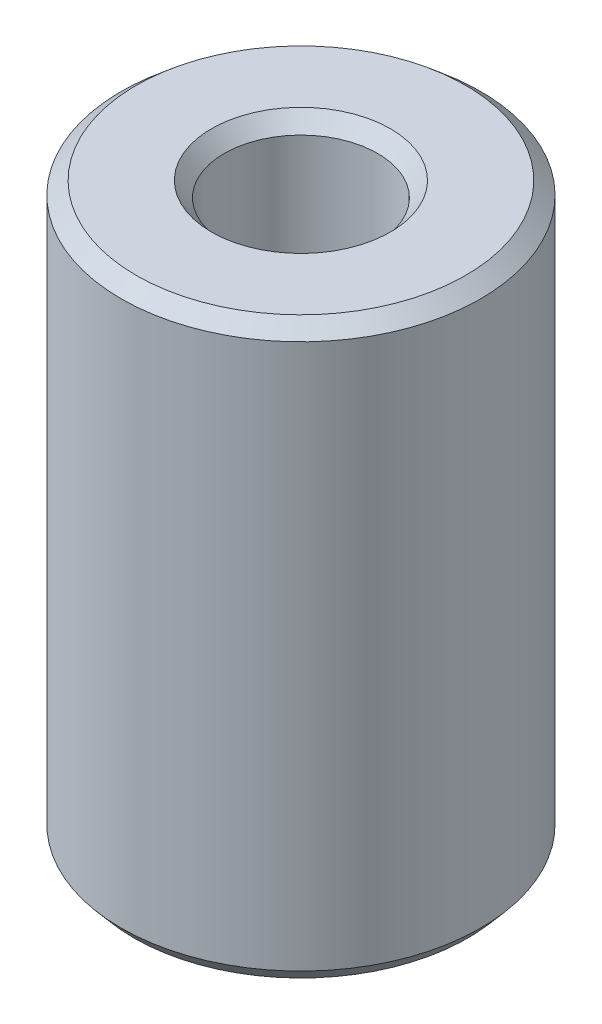
ISO-10303-21;
HEADER;
FILE_DESCRIPTION(('STEP AP214'),'2;1');
FILE_NAME('part.step','',(''),(''),'','','');
FILE_SCHEMA(('AUTOMOTIVE_DESIGN { 1 0 10303 214 1 1 1 1 }'));
ENDSEC;
DATA;
#1=APPLICATION_CONTEXT('core data for automotive mechanical design processes');
#2=APPLICATION_PROTOCOL_DEFINITION('international standard','automotive_design',2000,#1);
#3=PRODUCT_CONTEXT('',#1,'mechanical');
#4=PRODUCT('Part','Part','',(#3));
#5=PRODUCT_RELATED_PRODUCT_CATEGORY('part','',(#4));
#6=PRODUCT_DEFINITION_FORMATION('','',#4);
#7=PRODUCT_DEFINITION_CONTEXT('part definition',#1,'design');
#8=PRODUCT_DEFINITION('design','',#6,#7);
#9=PRODUCT_DEFINITION_SHAPE('','',#8);
#10=(LENGTH_UNIT() NAMED_UNIT(*) SI_UNIT(.MILLI.,.METRE.));
#11=(NAMED_UNIT(*) PLANE_ANGLE_UNIT() SI_UNIT($,.RADIAN.));
#12=(NAMED_UNIT(*) SI_UNIT($,.STERADIAN.) SOLID_ANGLE_UNIT());
#13=UNCERTAINTY_MEASURE_WITH_UNIT(LENGTH_MEASURE(1.E-05),#10,'distance_accuracy_value','');
#14=(GEOMETRIC_REPRESENTATION_CONTEXT(3) GLOBAL_UNCERTAINTY_ASSIGNED_CONTEXT((#13)) GLOBAL_UNIT_ASSIGNED_CONTEXT((#10,
#11,#12)) REPRESENTATION_CONTEXT('',''));
#15=CARTESIAN_POINT('',(0.,0.,0.));
#16=DIRECTION('',(0.,0.,1.));
#17=DIRECTION('',(1.,0.,0.));
#18=AXIS2_PLACEMENT_3D('',#15,#16,#17);
#19=CARTESIAN_POINT('',(0.,135.474291999624,0.));
#20=DIRECTION('',(0.,-1.,0.));
#21=DIRECTION('',(0.,0.,-1.));
#22=AXIS2_PLACEMENT_3D('',#19,#20,#21);
#23=CYLINDRICAL_SURFACE('',#22,42.5);
#24=CARTESIAN_POINT('',(0.,3.55246340525472,0.));
#25=DIRECTION('',(0.,1.,0.));
#26=DIRECTION('',(0.,0.,1.));
#27=AXIS2_PLACEMENT_3D('',#24,#25,#26);
#28=CIRCLE('',#27,42.5);
#29=CARTESIAN_POINT('',(0.,3.55246340525472,42.5));
#30=VERTEX_POINT('',#29);
#31=EDGE_CURVE('E10',#30,#30,#28,.T.);
#32=ORIENTED_EDGE('',*,*,#31,.T.);
#33=EDGE_LOOP('',(#32));
#34=FACE_BOUND('',#33,.T.);
#35=CARTESIAN_POINT('',(0.,132.453526323723,0.));
#36=DIRECTION('',(0.,1.,0.));
#37=DIRECTION('',(0.,0.,1.));
#38=AXIS2_PLACEMENT_3D('',#35,#36,#37);
#39=CIRCLE('',#38,42.5);
#40=CARTESIAN_POINT('',(0.,132.453526323723,42.5));
#41=VERTEX_POINT('',#40);
#42=EDGE_CURVE('E50',#41,#41,#39,.F.);
#43=ORIENTED_EDGE('',*,*,#42,.T.);
#44=EDGE_LOOP('',(#43));
#45=FACE_BOUND('',#44,.T.);
#46=ADVANCED_FACE('F39',(#34,#45),#23,.T.);
#47=CARTESIAN_POINT('',(0.,135.474291999624,0.));
#48=DIRECTION('',(0.,1.,0.));
#49=DIRECTION('',(0.,0.,1.));
#50=AXIS2_PLACEMENT_3D('',#47,#48,#49);
#51=PLANE('',#50);
#52=CARTESIAN_POINT('',(0.,135.474291999624,0.));
#53=DIRECTION('',(0.,1.,0.));
#54=DIRECTION('',(0.,0.,1.));
#55=AXIS2_PLACEMENT_3D('',#52,#53,#54);
#56=CIRCLE('',#55,21.1725533555586);
#57=CARTESIAN_POINT('',(0.,135.474291999624,21.1725533555586));
#58=VERTEX_POINT('',#57);
#59=EDGE_CURVE('E58',#58,#58,#56,.F.);
#60=ORIENTED_EDGE('',*,*,#59,.T.);
#61=EDGE_LOOP('',(#60));
#62=FACE_BOUND('',#61,.T.);
#63=CARTESIAN_POINT('',(0.,135.474291999624,0.));
#64=DIRECTION('',(0.,1.,0.));
#65=DIRECTION('',(0.,0.,1.));
#66=AXIS2_PLACEMENT_3D('',#63,#64,#65);
#67=CIRCLE('',#66,38.9475365947453);
#68=CARTESIAN_POINT('',(0.,135.474291999624,38.9475365947453));
#69=VERTEX_POINT('',#68);
#70=EDGE_CURVE('E61',#69,#69,#67,.T.);
#71=ORIENTED_EDGE('',*,*,#70,.T.);
#72=EDGE_LOOP('',(#71));
#73=FACE_BOUND('',#72,.T.);
#74=ADVANCED_FACE('F88',(#62,#73),#51,.T.);
#75=CARTESIAN_POINT('',(0.,0.,0.));
#76=DIRECTION('',(0.,1.,0.));
#77=DIRECTION('',(0.,0.,1.));
#78=AXIS2_PLACEMENT_3D('',#75,#76,#77);
#79=PLANE('',#78);
#80=CARTESIAN_POINT('',(0.,0.,0.));
#81=DIRECTION('',(0.,1.,0.));
#82=DIRECTION('',(0.,0.,1.));
#83=AXIS2_PLACEMENT_3D('',#80,#81,#82);
#84=CIRCLE('',#83,21.7042510849124);
#85=CARTESIAN_POINT('',(0.,0.,21.7042510849124));
#86=VERTEX_POINT('',#85);
#87=EDGE_CURVE('E51',#86,#86,#84,.T.);
#88=ORIENTED_EDGE('',*,*,#87,.T.);
#89=EDGE_LOOP('',(#88));
#90=FACE_BOUND('',#89,.T.);
#91=CARTESIAN_POINT('',(0.,0.,0.));
#92=DIRECTION('',(0.,1.,0.));
#93=DIRECTION('',(0.,0.,1.));
#94=AXIS2_PLACEMENT_3D('',#91,#92,#93);
#95=CIRCLE('',#94,39.479234324099);
#96=CARTESIAN_POINT('',(0.,0.,39.479234324099));
#97=VERTEX_POINT('',#96);
#98=EDGE_CURVE('E54',#97,#97,#95,.F.);
#99=ORIENTED_EDGE('',*,*,#98,.T.);
#100=EDGE_LOOP('',(#99));
#101=FACE_BOUND('',#100,.T.);
#102=ADVANCED_FACE('F83',(#90,#101),#79,.F.);
#103=CARTESIAN_POINT('',(0.,135.474291999624,0.));
#104=DIRECTION('',(0.,-1.,0.));
#105=DIRECTION('',(0.,0.,-1.));
#106=AXIS2_PLACEMENT_3D('',#103,#104,#105);
#107=CYLINDRICAL_SURFACE('',#106,18.1517876796576);
#108=CARTESIAN_POINT('',(0.,131.921828594369,0.));
#109=DIRECTION('',(0.,1.,0.));
#110=DIRECTION('',(0.,0.,1.));
#111=AXIS2_PLACEMENT_3D('',#108,#109,#110);
#112=CIRCLE('',#111,18.1517876796576);
#113=CARTESIAN_POINT('',(0.,131.921828594369,18.1517876796576));
#114=VERTEX_POINT('',#113);
#115=EDGE_CURVE('E67',#114,#114,#112,.T.);
#116=ORIENTED_EDGE('',*,*,#115,.T.);
#117=EDGE_LOOP('',(#116));
#118=FACE_BOUND('',#117,.T.);
#119=CARTESIAN_POINT('',(0.,3.02076567590104,0.));
#120=DIRECTION('',(0.,1.,0.));
#121=DIRECTION('',(0.,0.,1.));
#122=AXIS2_PLACEMENT_3D('',#119,#120,#121);
#123=CIRCLE('',#122,18.1517876796576);
#124=CARTESIAN_POINT('',(0.,3.02076567590104,18.1517876796576));
#125=VERTEX_POINT('',#124);
#126=EDGE_CURVE('E69',#125,#125,#123,.F.);
#127=ORIENTED_EDGE('',*,*,#126,.T.);
#128=EDGE_LOOP('',(#127));
#129=FACE_BOUND('',#128,.T.);
#130=ADVANCED_FACE('F71',(#118,#129),#107,.F.);
#131=CARTESIAN_POINT('',(0.,131.921828594369,0.));
#132=DIRECTION('',(0.,1.,0.));
#133=DIRECTION('',(0.,0.,1.));
#134=AXIS2_PLACEMENT_3D('',#131,#132,#133);
#135=CONICAL_SURFACE('',#134,18.1517876796576,0.704685528220858);
#136=CARTESIAN_POINT('',(0.,135.474291999624,21.1725533555586));
#137=CARTESIAN_POINT('',(0.,135.437287172486,21.1410870464347));
#138=CARTESIAN_POINT('',(0.,135.400282345347,21.1096207373107));
#139=CARTESIAN_POINT('',(0.,135.326272691071,21.0466881190627));
#140=CARTESIAN_POINT('',(0.,135.289267863933,21.0152218099388));
#141=CARTESIAN_POINT('',(0.,135.215258209657,20.9522891916908));
#142=CARTESIAN_POINT('',(0.,135.178253382519,20.9208228825669));
#143=CARTESIAN_POINT('',(0.,135.104243728243,20.8578902643189));
#144=CARTESIAN_POINT('',(0.,135.067238901105,20.826423955195));
#145=CARTESIAN_POINT('',(0.,134.993229246829,20.763491336947));
#146=CARTESIAN_POINT('',(0.,134.956224419691,20.7320250278231));
#147=CARTESIAN_POINT('',(0.,134.882214765415,20.6690924095751));
#148=CARTESIAN_POINT('',(0.,134.845209938276,20.6376261004512));
#149=CARTESIAN_POINT('',(0.,134.771200284,20.5746934822032));
#150=CARTESIAN_POINT('',(0.,134.734195456862,20.5432271730792));
#151=CARTESIAN_POINT('',(0.,134.660185802586,20.4802945548313));
#152=CARTESIAN_POINT('',(0.,134.623180975448,20.4488282457073));
#153=CARTESIAN_POINT('',(0.,134.549171321172,20.3858956274594));
#154=CARTESIAN_POINT('',(0.,134.512166494034,20.3544293183354));
#155=CARTESIAN_POINT('',(0.,134.438156839758,20.2914967000875));
#156=CARTESIAN_POINT('',(0.,134.40115201262,20.2600303909635));
#157=CARTESIAN_POINT('',(0.,134.327142358343,20.1970977727156));
#158=CARTESIAN_POINT('',(0.,134.290137531205,20.1656314635916));
#159=CARTESIAN_POINT('',(0.,134.216127876929,20.1026988453437));
#160=CARTESIAN_POINT('',(0.,134.179123049791,20.0712325362197));
#161=CARTESIAN_POINT('',(0.,134.105113395515,20.0082999179718));
#162=CARTESIAN_POINT('',(0.,134.068108568377,19.9768336088478));
#163=CARTESIAN_POINT('',(0.,133.994098914101,19.9139009905999));
#164=CARTESIAN_POINT('',(0.,133.957094086963,19.8824346814759));
#165=CARTESIAN_POINT('',(0.,133.883084432687,19.819502063228));
#166=CARTESIAN_POINT('',(0.,133.846079605549,19.788035754104));
#167=CARTESIAN_POINT('',(0.,133.772069951272,19.7251031358561));
#168=CARTESIAN_POINT('',(0.,133.735065124134,19.6936368267321));
#169=CARTESIAN_POINT('',(0.,133.661055469858,19.6307042084842));
#170=CARTESIAN_POINT('',(0.,133.62405064272,19.5992378993602));
#171=CARTESIAN_POINT('',(0.,133.550040988444,19.5363052811122));
#172=CARTESIAN_POINT('',(0.,133.513036161306,19.5048389719883));
#173=CARTESIAN_POINT('',(0.,133.43902650703,19.4419063537403));
#174=CARTESIAN_POINT('',(0.,133.402021679892,19.4104400446164));
#175=CARTESIAN_POINT('',(0.,133.328012025616,19.3475074263684));
#176=CARTESIAN_POINT('',(0.,133.291007198477,19.3160411172445));
#177=CARTESIAN_POINT('',(0.,133.216997544201,19.2531084989965));
#178=CARTESIAN_POINT('',(0.,133.179992717063,19.2216421898726));
#179=CARTESIAN_POINT('',(0.,133.105983062787,19.1587095716246));
#180=CARTESIAN_POINT('',(0.,133.068978235649,19.1272432625007));
#181=CARTESIAN_POINT('',(0.,132.994968581373,19.0643106442527));
#182=CARTESIAN_POINT('',(0.,132.957963754235,19.0328443351287));
#183=CARTESIAN_POINT('',(0.,132.883954099959,18.9699117168808));
#184=CARTESIAN_POINT('',(0.,132.846949272821,18.9384454077568));
#185=CARTESIAN_POINT('',(0.,132.772939618545,18.8755127895089));
#186=CARTESIAN_POINT('',(0.,132.735934791406,18.8440464803849));
#187=CARTESIAN_POINT('',(0.,132.66192513713,18.781113862137));
#188=CARTESIAN_POINT('',(0.,132.624920309992,18.749647553013));
#189=CARTESIAN_POINT('',(0.,132.550910655716,18.6867149347651));
#190=CARTESIAN_POINT('',(0.,132.513905828578,18.6552486256411));
#191=CARTESIAN_POINT('',(0.,132.439896174302,18.5923160073932));
#192=CARTESIAN_POINT('',(0.,132.402891347164,18.5608496982692));
#193=CARTESIAN_POINT('',(0.,132.328881692888,18.4979170800213));
#194=CARTESIAN_POINT('',(0.,132.29187686575,18.4664507708973));
#195=CARTESIAN_POINT('',(0.,132.217867211473,18.4035181526494));
#196=CARTESIAN_POINT('',(0.,132.180862384335,18.3720518435254));
#197=CARTESIAN_POINT('',(0.,132.106852730059,18.3091192252775));
#198=CARTESIAN_POINT('',(0.,132.069847902921,18.2776529161535));
#199=CARTESIAN_POINT('',(0.,131.995838248645,18.2147202979056));
#200=CARTESIAN_POINT('',(0.,131.958833421507,18.1832539887816));
#201=CARTESIAN_POINT('',(0.,131.921828594369,18.1517876796576));
#202=B_SPLINE_CURVE_WITH_KNOTS('',3,(#136,#137,#138,#139,#140,#141,#142,#143,#144,#145,#146,
#147,#148,#149,#150,#151,#152,#153,#154,#155,#156,#157,#158,#159,#160,#161,#162,#163,#164,#165,
#166,#167,#168,#169,#170,#171,#172,#173,#174,#175,#176,#177,#178,#179,#180,#181,#182,#183,#184,
#185,#186,#187,#188,#189,#190,#191,#192,#193,#194,#195,#196,#197,#198,#199,#200,#201),
.UNSPECIFIED.,.F.,.F.,(4,2,2,2,2,2,2,2,2,2,2,2,2,2,2,2,2,2,2,2,2,2,2,2,2,2,2,2,2,2,2,2,4),(0.,
0.145723617072289,0.291447234144581,0.43717085121687,0.582894468289162,0.728618085361454,
0.874341702433743,1.02006531950603,1.16578893657835,1.31151255365064,1.45723617072293,
1.60295978779522,1.74868340486751,1.8944070219398,2.04013063901209,2.18585425608438,
2.33157787315669,2.47730149022898,2.62302510730128,2.76874872437357,2.91447234144586,
3.06019595851815,3.20591957559044,3.35164319266273,3.49736680973504,3.64309042680733,
3.78881404387962,3.93453766095191,4.0802612780242,4.2259848950965,4.37170851216878,
4.51743212924108,4.66315574631337),.UNSPECIFIED.);
#203=EDGE_CURVE('BSEAM77',#58,#114,#202,.T.);
#204=ORIENTED_EDGE('',*,*,#59,.F.);
#205=ORIENTED_EDGE('',*,*,#115,.F.);
#206=ORIENTED_EDGE('',*,*,#203,.T.);
#207=ORIENTED_EDGE('',*,*,#203,.F.);
#208=EDGE_LOOP('',(#204,#206,#205,#207));
#209=FACE_BOUND('',#208,.T.);
#210=ADVANCED_FACE('F77',(#209),#135,.F.);
#211=CARTESIAN_POINT('',(0.,0.,0.));
#212=DIRECTION('',(0.,-1.,0.));
#213=DIRECTION('',(0.,0.,-1.));
#214=AXIS2_PLACEMENT_3D('',#211,#212,#213);
#215=CONICAL_SURFACE('',#214,21.7042510849124,0.866110798574036);
#216=ORIENTED_EDGE('',*,*,#126,.F.);
#217=EDGE_LOOP('',(#216));
#218=FACE_BOUND('',#217,.T.);
#219=ORIENTED_EDGE('',*,*,#87,.F.);
#220=EDGE_LOOP('',(#219));
#221=FACE_BOUND('',#220,.T.);
#222=ADVANCED_FACE('F73',(#218,#221),#215,.F.);
#223=CARTESIAN_POINT('',(0.,3.55246340525472,0.));
#224=DIRECTION('',(0.,1.,0.));
#225=DIRECTION('',(0.,0.,1.));
#226=AXIS2_PLACEMENT_3D('',#223,#224,#225);
#227=CONICAL_SURFACE('',#226,42.5,0.704685528220858);
#228=CARTESIAN_POINT('',(0.,0.,39.479234324099));
#229=CARTESIAN_POINT('',(0.,0.0370048271380713,39.510700633223));
#230=CARTESIAN_POINT('',(0.,0.0740096542761408,39.5421669423469));
#231=CARTESIAN_POINT('',(0.,0.14801930855228,39.6050995605949));
#232=CARTESIAN_POINT('',(0.,0.185024135690349,39.6365658697189));
#233=CARTESIAN_POINT('',(0.,0.259033789966489,39.6994984879668));
#234=CARTESIAN_POINT('',(0.,0.29603861710456,39.7309647970908));
#235=CARTESIAN_POINT('',(0.,0.3700482713807,39.7938974153387));
#236=CARTESIAN_POINT('',(0.,0.40705309851877,39.8253637244627));
#237=CARTESIAN_POINT('',(0.,0.48106275279491,39.8882963427106));
#238=CARTESIAN_POINT('',(0.,0.518067579932981,39.9197626518346));
#239=CARTESIAN_POINT('',(0.,0.592077234209121,39.9826952700825));
#240=CARTESIAN_POINT('',(0.,0.62908206134719,40.0141615792065));
#241=CARTESIAN_POINT('',(0.,0.70309171562333,40.0770941974544));
#242=CARTESIAN_POINT('',(0.,0.7400965427614,40.1085605065784));
#243=CARTESIAN_POINT('',(0.,0.814106197037541,40.1714931248263));
#244=CARTESIAN_POINT('',(0.,0.851111024175611,40.2029594339503));
#245=CARTESIAN_POINT('',(0.,0.925120678451751,40.2658920521982));
#246=CARTESIAN_POINT('',(0.,0.96212550558982,40.2973583613222));
#247=CARTESIAN_POINT('',(0.,1.03613515986596,40.3602909795701));
#248=CARTESIAN_POINT('',(0.,1.07313998700403,40.3917572886941));
#249=CARTESIAN_POINT('',(0.,1.14714964128017,40.454689906942));
#250=CARTESIAN_POINT('',(0.,1.18415446841824,40.486156216066));
#251=CARTESIAN_POINT('',(0.,1.25816412269438,40.5490888343139));
#252=CARTESIAN_POINT('',(0.,1.29516894983245,40.5805551434379));
#253=CARTESIAN_POINT('',(0.,1.36917860410859,40.6434877616859));
#254=CARTESIAN_POINT('',(0.,1.40618343124666,40.6749540708098));
#255=CARTESIAN_POINT('',(0.,1.4801930855228,40.7378866890578));
#256=CARTESIAN_POINT('',(0.,1.51719791266087,40.7693529981817));
#257=CARTESIAN_POINT('',(0.,1.59120756693701,40.8322856164297));
#258=CARTESIAN_POINT('',(0.,1.62821239407508,40.8637519255536));
#259=CARTESIAN_POINT('',(0.,1.70222204835122,40.9266845438016));
#260=CARTESIAN_POINT('',(0.,1.73922687548929,40.9581508529255));
#261=CARTESIAN_POINT('',(0.,1.81323652976543,41.0210834711735));
#262=CARTESIAN_POINT('',(0.,1.8502413569035,41.0525497802974));
#263=CARTESIAN_POINT('',(0.,1.92425101117964,41.1154823985454));
#264=CARTESIAN_POINT('',(0.,1.96125583831771,41.1469487076694));
#265=CARTESIAN_POINT('',(0.,2.03526549259385,41.2098813259173));
#266=CARTESIAN_POINT('',(0.,2.07227031973192,41.2413476350413));
#267=CARTESIAN_POINT('',(0.,2.14627997400806,41.3042802532892));
#268=CARTESIAN_POINT('',(0.,2.18328480114613,41.3357465624132));
#269=CARTESIAN_POINT('',(0.,2.25729445542227,41.3986791806611));
#270=CARTESIAN_POINT('',(0.,2.29429928256034,41.4301454897851));
#271=CARTESIAN_POINT('',(0.,2.36830893683648,41.493078108033));
#272=CARTESIAN_POINT('',(0.,2.40531376397455,41.524544417157));
#273=CARTESIAN_POINT('',(0.,2.47932341825069,41.5874770354049));
#274=CARTESIAN_POINT('',(0.,2.51632824538876,41.6189433445289));
#275=CARTESIAN_POINT('',(0.,2.5903378996649,41.6818759627768));
#276=CARTESIAN_POINT('',(0.,2.62734272680297,41.7133422719008));
#277=CARTESIAN_POINT('',(0.,2.70135238107911,41.7762748901487));
#278=CARTESIAN_POINT('',(0.,2.73835720821718,41.8077411992727));
#279=CARTESIAN_POINT('',(0.,2.81236686249332,41.8706738175206));
#280=CARTESIAN_POINT('',(0.,2.84937168963139,41.9021401266446));
#281=CARTESIAN_POINT('',(0.,2.92338134390753,41.9650727448925));
#282=CARTESIAN_POINT('',(0.,2.9603861710456,41.9965390540165));
#283=CARTESIAN_POINT('',(0.,3.03439582532174,42.0594716722644));
#284=CARTESIAN_POINT('',(0.,3.07140065245981,42.0909379813884));
#285=CARTESIAN_POINT('',(0.,3.14541030673595,42.1538705996364));
#286=CARTESIAN_POINT('',(0.,3.18241513387402,42.1853369087603));
#287=CARTESIAN_POINT('',(0.,3.25642478815016,42.2482695270083));
#288=CARTESIAN_POINT('',(0.,3.29342961528823,42.2797358361322));
#289=CARTESIAN_POINT('',(0.,3.36743926956437,42.3426684543802));
#290=CARTESIAN_POINT('',(0.,3.40444409670244,42.3741347635041));
#291=CARTESIAN_POINT('',(0.,3.47845375097858,42.4370673817521));
#292=CARTESIAN_POINT('',(0.,3.51545857811665,42.468533690876));
#293=CARTESIAN_POINT('',(0.,3.55246340525472,42.5));
#294=B_SPLINE_CURVE_WITH_KNOTS('',3,(#228,#229,#230,#231,#232,#233,#234,#235,#236,#237,#238,
#239,#240,#241,#242,#243,#244,#245,#246,#247,#248,#249,#250,#251,#252,#253,#254,#255,#256,#257,
#258,#259,#260,#261,#262,#263,#264,#265,#266,#267,#268,#269,#270,#271,#272,#273,#274,#275,#276,
#277,#278,#279,#280,#281,#282,#283,#284,#285,#286,#287,#288,#289,#290,#291,#292,#293),
.UNSPECIFIED.,.F.,.F.,(4,2,2,2,2,2,2,2,2,2,2,2,2,2,2,2,2,2,2,2,2,2,2,2,2,2,2,2,2,2,2,2,4),(0.,
0.145723617072292,0.291447234144589,0.437170851216881,0.582894468289173,0.728618085361465,
0.874341702433761,1.02006531950605,1.16578893657835,1.31151255365064,1.45723617072293,
1.60295978779523,1.74868340486752,1.89440702193982,2.04013063901211,2.1858542560844,
2.3315778731567,2.47730149022899,2.62302510730128,2.76874872437358,2.91447234144587,
3.06019595851817,3.20591957559046,3.35164319266275,3.49736680973504,3.64309042680734,
3.78881404387963,3.93453766095192,4.08026127802422,4.22598489509651,4.3717085121688,
4.5174321292411,4.66315574631339),.UNSPECIFIED.);
#295=EDGE_CURVE('BSEAM76',#97,#30,#294,.T.);
#296=ORIENTED_EDGE('',*,*,#98,.F.);
#297=ORIENTED_EDGE('',*,*,#31,.F.);
#298=ORIENTED_EDGE('',*,*,#295,.T.);
#299=ORIENTED_EDGE('',*,*,#295,.F.);
#300=EDGE_LOOP('',(#296,#298,#297,#299));
#301=FACE_BOUND('',#300,.T.);
#302=ADVANCED_FACE('F76',(#301),#227,.T.);
#303=CARTESIAN_POINT('',(0.,135.474291999624,0.));
#304=DIRECTION('',(0.,-1.,0.));
#305=DIRECTION('',(0.,0.,-1.));
#306=AXIS2_PLACEMENT_3D('',#303,#304,#305);
#307=CONICAL_SURFACE('',#306,38.9475365947453,0.866110798574036);
#308=ORIENTED_EDGE('',*,*,#42,.F.);
#309=EDGE_LOOP('',(#308));
#310=FACE_BOUND('',#309,.T.);
#311=ORIENTED_EDGE('',*,*,#70,.F.);
#312=EDGE_LOOP('',(#311));
#313=FACE_BOUND('',#312,.T.);
#314=ADVANCED_FACE('F45',(#310,#313),#307,.T.);
#315=CLOSED_SHELL('',(#46,#74,#102,#130,#210,#222,#302,#314));
#316=MANIFOLD_SOLID_BREP('B2',#315);
#317=ADVANCED_BREP_SHAPE_REPRESENTATION('',(#18,#316),#14);
#318=SHAPE_DEFINITION_REPRESENTATION(#9,#317);
ENDSEC;
END-ISO-10303-21;
